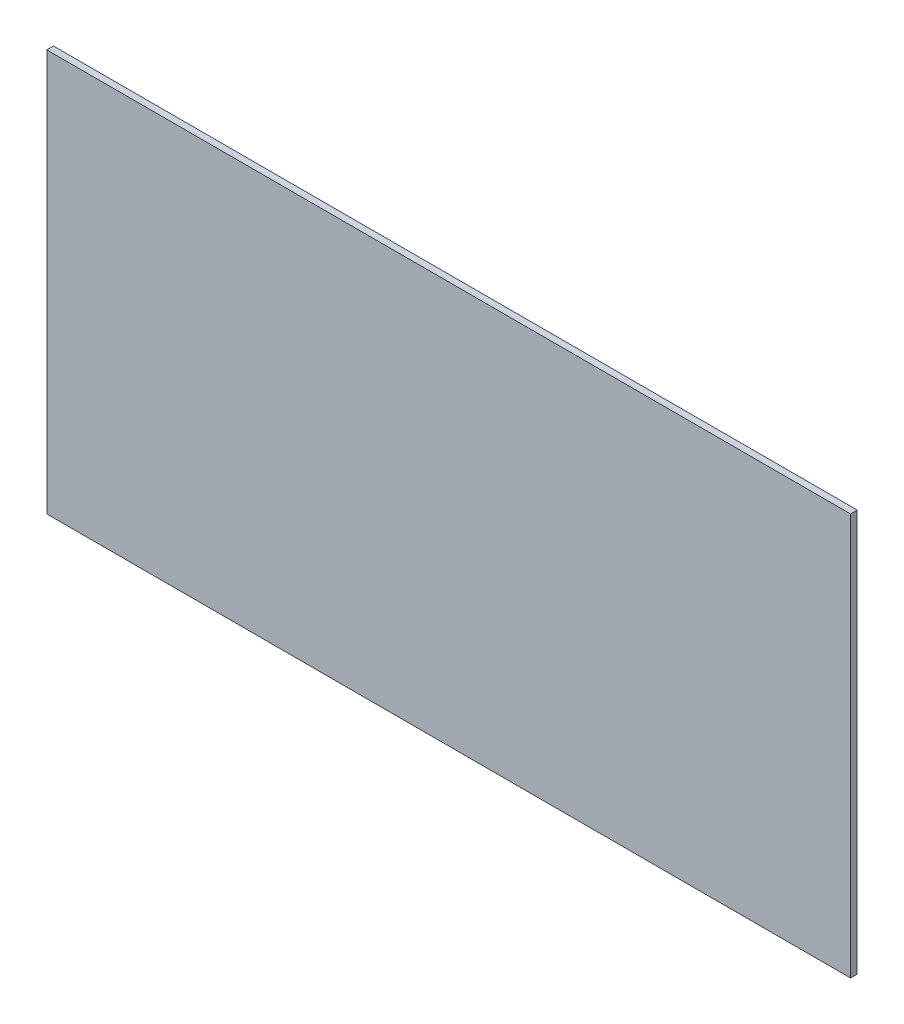
ISO-10303-21;
HEADER;
FILE_DESCRIPTION(('STEP AP214'),'2;1');
FILE_NAME('part.step','',(''),(''),'','','');
FILE_SCHEMA(('AUTOMOTIVE_DESIGN { 1 0 10303 214 1 1 1 1 }'));
ENDSEC;
DATA;
#1=APPLICATION_CONTEXT('core data for automotive mechanical design processes');
#2=APPLICATION_PROTOCOL_DEFINITION('international standard','automotive_design',2000,#1);
#3=PRODUCT_CONTEXT('',#1,'mechanical');
#4=PRODUCT('Part','Part','',(#3));
#5=PRODUCT_RELATED_PRODUCT_CATEGORY('part','',(#4));
#6=PRODUCT_DEFINITION_FORMATION('','',#4);
#7=PRODUCT_DEFINITION_CONTEXT('part definition',#1,'design');
#8=PRODUCT_DEFINITION('design','',#6,#7);
#9=PRODUCT_DEFINITION_SHAPE('','',#8);
#10=(LENGTH_UNIT() NAMED_UNIT(*) SI_UNIT(.MILLI.,.METRE.));
#11=(NAMED_UNIT(*) PLANE_ANGLE_UNIT() SI_UNIT($,.RADIAN.));
#12=(NAMED_UNIT(*) SI_UNIT($,.STERADIAN.) SOLID_ANGLE_UNIT());
#13=UNCERTAINTY_MEASURE_WITH_UNIT(LENGTH_MEASURE(1.E-05),#10,'distance_accuracy_value','');
#14=(GEOMETRIC_REPRESENTATION_CONTEXT(3) GLOBAL_UNCERTAINTY_ASSIGNED_CONTEXT((#13)) GLOBAL_UNIT_ASSIGNED_CONTEXT((#10,
#11,#12)) REPRESENTATION_CONTEXT('',''));
#15=CARTESIAN_POINT('',(0.,0.,0.));
#16=DIRECTION('',(0.,0.,1.));
#17=DIRECTION('',(1.,0.,0.));
#18=AXIS2_PLACEMENT_3D('',#15,#16,#17);
#19=CARTESIAN_POINT('',(0.,0.,-1.));
#20=DIRECTION('',(-1.,0.,0.));
#21=DIRECTION('',(0.,-1.,0.));
#22=AXIS2_PLACEMENT_3D('',#19,#20,#21);
#23=PLANE('',#22);
#24=DIRECTION('',(0.,-1.,0.));
#25=VECTOR('',#24,1.);
#26=CARTESIAN_POINT('',(0.,0.,0.));
#27=LINE('',#26,#25);
#28=CARTESIAN_POINT('',(0.,60.,0.));
#29=VERTEX_POINT('',#28);
#30=CARTESIAN_POINT('',(0.,0.,0.));
#31=VERTEX_POINT('',#30);
#32=EDGE_CURVE('E100',#29,#31,#27,.T.);
#33=ORIENTED_EDGE('',*,*,#32,.F.);
#34=DIRECTION('',(0.,0.,1.));
#35=VECTOR('',#34,1.);
#36=CARTESIAN_POINT('',(0.,60.,-1.));
#37=LINE('',#36,#35);
#38=CARTESIAN_POINT('',(0.,60.,-1.));
#39=VERTEX_POINT('',#38);
#40=EDGE_CURVE('E11',#39,#29,#37,.T.);
#41=ORIENTED_EDGE('',*,*,#40,.F.);
#42=DIRECTION('',(0.,-1.,0.));
#43=VECTOR('',#42,1.);
#44=CARTESIAN_POINT('',(0.,0.,-1.));
#45=LINE('',#44,#43);
#46=CARTESIAN_POINT('',(0.,0.,-1.));
#47=VERTEX_POINT('',#46);
#48=EDGE_CURVE('E94',#39,#47,#45,.T.);
#49=ORIENTED_EDGE('',*,*,#48,.T.);
#50=DIRECTION('',(0.,0.,1.));
#51=VECTOR('',#50,1.);
#52=CARTESIAN_POINT('',(0.,0.,-1.));
#53=LINE('',#52,#51);
#54=EDGE_CURVE('E39',#47,#31,#53,.T.);
#55=ORIENTED_EDGE('',*,*,#54,.T.);
#56=EDGE_LOOP('',(#33,#41,#49,#55));
#57=FACE_BOUND('',#56,.T.);
#58=ADVANCED_FACE('F36',(#57),#23,.T.);
#59=CARTESIAN_POINT('',(0.,60.,-1.));
#60=DIRECTION('',(0.,1.,0.));
#61=DIRECTION('',(0.,0.,1.));
#62=AXIS2_PLACEMENT_3D('',#59,#60,#61);
#63=PLANE('',#62);
#64=DIRECTION('',(-1.,0.,0.));
#65=VECTOR('',#64,1.);
#66=CARTESIAN_POINT('',(0.,60.,0.));
#67=LINE('',#66,#65);
#68=CARTESIAN_POINT('',(120.,60.,0.));
#69=VERTEX_POINT('',#68);
#70=EDGE_CURVE('E96',#69,#29,#67,.T.);
#71=ORIENTED_EDGE('',*,*,#70,.F.);
#72=DIRECTION('',(0.,0.,1.));
#73=VECTOR('',#72,1.);
#74=CARTESIAN_POINT('',(120.,60.,-1.));
#75=LINE('',#74,#73);
#76=CARTESIAN_POINT('',(120.,60.,-1.));
#77=VERTEX_POINT('',#76);
#78=EDGE_CURVE('E45',#77,#69,#75,.T.);
#79=ORIENTED_EDGE('',*,*,#78,.F.);
#80=DIRECTION('',(-1.,0.,0.));
#81=VECTOR('',#80,1.);
#82=CARTESIAN_POINT('',(0.,60.,-1.));
#83=LINE('',#82,#81);
#84=EDGE_CURVE('E91',#77,#39,#83,.T.);
#85=ORIENTED_EDGE('',*,*,#84,.T.);
#86=ORIENTED_EDGE('',*,*,#40,.T.);
#87=EDGE_LOOP('',(#71,#79,#85,#86));
#88=FACE_BOUND('',#87,.T.);
#89=ADVANCED_FACE('F110',(#88),#63,.T.);
#90=CARTESIAN_POINT('',(120.,0.,-1.));
#91=DIRECTION('',(1.,0.,0.));
#92=DIRECTION('',(0.,1.,0.));
#93=AXIS2_PLACEMENT_3D('',#90,#91,#92);
#94=PLANE('',#93);
#95=DIRECTION('',(0.,1.,0.));
#96=VECTOR('',#95,1.);
#97=CARTESIAN_POINT('',(120.,0.,0.));
#98=LINE('',#97,#96);
#99=CARTESIAN_POINT('',(120.,0.,0.));
#100=VERTEX_POINT('',#99);
#101=EDGE_CURVE('E86',#100,#69,#98,.T.);
#102=ORIENTED_EDGE('',*,*,#101,.F.);
#103=DIRECTION('',(0.,0.,1.));
#104=VECTOR('',#103,1.);
#105=CARTESIAN_POINT('',(120.,0.,-1.));
#106=LINE('',#105,#104);
#107=CARTESIAN_POINT('',(120.,0.,-1.));
#108=VERTEX_POINT('',#107);
#109=EDGE_CURVE('E81',#108,#100,#106,.T.);
#110=ORIENTED_EDGE('',*,*,#109,.F.);
#111=DIRECTION('',(0.,1.,0.));
#112=VECTOR('',#111,1.);
#113=CARTESIAN_POINT('',(120.,0.,-1.));
#114=LINE('',#113,#112);
#115=EDGE_CURVE('E84',#108,#77,#114,.T.);
#116=ORIENTED_EDGE('',*,*,#115,.T.);
#117=ORIENTED_EDGE('',*,*,#78,.T.);
#118=EDGE_LOOP('',(#102,#110,#116,#117));
#119=FACE_BOUND('',#118,.T.);
#120=ADVANCED_FACE('F83',(#119),#94,.T.);
#121=CARTESIAN_POINT('',(0.,0.,-1.));
#122=DIRECTION('',(0.,-1.,0.));
#123=DIRECTION('',(0.,0.,-1.));
#124=AXIS2_PLACEMENT_3D('',#121,#122,#123);
#125=PLANE('',#124);
#126=DIRECTION('',(1.,0.,0.));
#127=VECTOR('',#126,1.);
#128=CARTESIAN_POINT('',(0.,0.,0.));
#129=LINE('',#128,#127);
#130=EDGE_CURVE('E103',#31,#100,#129,.T.);
#131=ORIENTED_EDGE('',*,*,#130,.F.);
#132=ORIENTED_EDGE('',*,*,#54,.F.);
#133=DIRECTION('',(1.,0.,0.));
#134=VECTOR('',#133,1.);
#135=CARTESIAN_POINT('',(0.,0.,-1.));
#136=LINE('',#135,#134);
#137=EDGE_CURVE('E90',#47,#108,#136,.T.);
#138=ORIENTED_EDGE('',*,*,#137,.T.);
#139=ORIENTED_EDGE('',*,*,#109,.T.);
#140=EDGE_LOOP('',(#131,#132,#138,#139));
#141=FACE_BOUND('',#140,.T.);
#142=ADVANCED_FACE('F93',(#141),#125,.T.);
#143=CARTESIAN_POINT('',(0.,0.,-1.));
#144=DIRECTION('',(0.,0.,-1.));
#145=DIRECTION('',(-1.,0.,0.));
#146=AXIS2_PLACEMENT_3D('',#143,#144,#145);
#147=PLANE('',#146);
#148=ORIENTED_EDGE('',*,*,#48,.F.);
#149=ORIENTED_EDGE('',*,*,#84,.F.);
#150=ORIENTED_EDGE('',*,*,#115,.F.);
#151=ORIENTED_EDGE('',*,*,#137,.F.);
#152=EDGE_LOOP('',(#148,#149,#150,#151));
#153=FACE_BOUND('',#152,.T.);
#154=ADVANCED_FACE('F89',(#153),#147,.T.);
#155=CARTESIAN_POINT('',(0.,0.,0.));
#156=DIRECTION('',(0.,0.,-1.));
#157=DIRECTION('',(-1.,0.,0.));
#158=AXIS2_PLACEMENT_3D('',#155,#156,#157);
#159=PLANE('',#158);
#160=ORIENTED_EDGE('',*,*,#32,.T.);
#161=ORIENTED_EDGE('',*,*,#130,.T.);
#162=ORIENTED_EDGE('',*,*,#101,.T.);
#163=ORIENTED_EDGE('',*,*,#70,.T.);
#164=EDGE_LOOP('',(#160,#161,#162,#163));
#165=FACE_BOUND('',#164,.T.);
#166=ADVANCED_FACE('F109',(#165),#159,.F.);
#167=CLOSED_SHELL('',(#58,#89,#120,#142,#154,#166));
#168=MANIFOLD_SOLID_BREP('B2',#167);
#169=ADVANCED_BREP_SHAPE_REPRESENTATION('',(#18,#168),#14);
#170=SHAPE_DEFINITION_REPRESENTATION(#9,#169);
ENDSEC;
END-ISO-10303-21;
